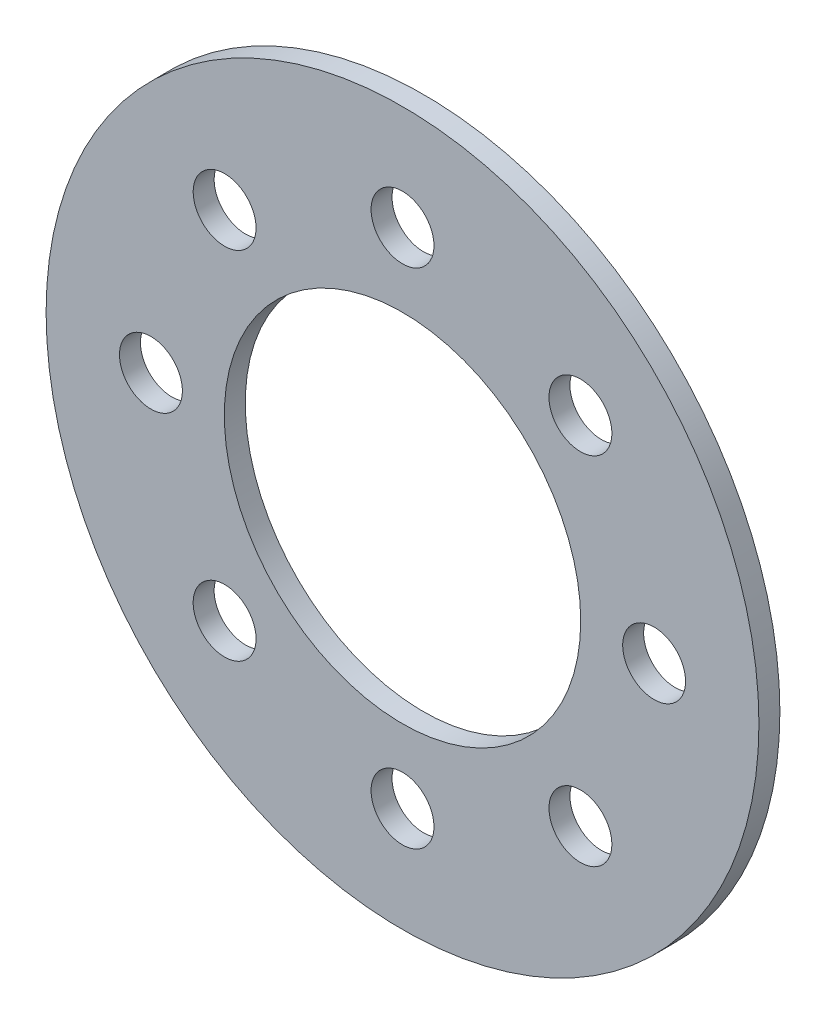
ISO-10303-21;
HEADER;
FILE_DESCRIPTION(('STEP AP214'),'2;1');
FILE_NAME('part.step','',(''),(''),'','','');
FILE_SCHEMA(('AUTOMOTIVE_DESIGN { 1 0 10303 214 1 1 1 1 }'));
ENDSEC;
DATA;
#1=APPLICATION_CONTEXT('core data for automotive mechanical design processes');
#2=APPLICATION_PROTOCOL_DEFINITION('international standard','automotive_design',2000,#1);
#3=PRODUCT_CONTEXT('',#1,'mechanical');
#4=PRODUCT('Part','Part','',(#3));
#5=PRODUCT_RELATED_PRODUCT_CATEGORY('part','',(#4));
#6=PRODUCT_DEFINITION_FORMATION('','',#4);
#7=PRODUCT_DEFINITION_CONTEXT('part definition',#1,'design');
#8=PRODUCT_DEFINITION('design','',#6,#7);
#9=PRODUCT_DEFINITION_SHAPE('','',#8);
#10=(LENGTH_UNIT() NAMED_UNIT(*) SI_UNIT(.MILLI.,.METRE.));
#11=(NAMED_UNIT(*) PLANE_ANGLE_UNIT() SI_UNIT($,.RADIAN.));
#12=(NAMED_UNIT(*) SI_UNIT($,.STERADIAN.) SOLID_ANGLE_UNIT());
#13=UNCERTAINTY_MEASURE_WITH_UNIT(LENGTH_MEASURE(1.E-05),#10,'distance_accuracy_value','');
#14=(GEOMETRIC_REPRESENTATION_CONTEXT(3) GLOBAL_UNCERTAINTY_ASSIGNED_CONTEXT((#13)) GLOBAL_UNIT_ASSIGNED_CONTEXT((#10,
#11,#12)) REPRESENTATION_CONTEXT('',''));
#15=CARTESIAN_POINT('',(0.,0.,0.));
#16=DIRECTION('',(0.,0.,1.));
#17=DIRECTION('',(1.,0.,0.));
#18=AXIS2_PLACEMENT_3D('',#15,#16,#17);
#19=CARTESIAN_POINT('',(0.,0.,1.));
#20=DIRECTION('',(0.,0.,1.));
#21=DIRECTION('',(1.,0.,0.));
#22=AXIS2_PLACEMENT_3D('',#19,#20,#21);
#23=PLANE('',#22);
#24=CARTESIAN_POINT('',(12.,0.,1.));
#25=DIRECTION('',(0.,0.,1.));
#26=DIRECTION('',(0.,-1.,0.));
#27=AXIS2_PLACEMENT_3D('',#24,#25,#26);
#28=CIRCLE('',#27,1.5);
#29=CARTESIAN_POINT('',(12.,-1.50000000000004,1.));
#30=VERTEX_POINT('',#29);
#31=EDGE_CURVE('E87',#30,#30,#28,.T.);
#32=ORIENTED_EDGE('',*,*,#31,.F.);
#33=EDGE_LOOP('',(#32));
#34=FACE_BOUND('',#33,.T.);
#35=CARTESIAN_POINT('',(8.48528137423853,-8.48528137423861,1.));
#36=DIRECTION('',(0.,0.,1.));
#37=DIRECTION('',(-0.707106781186551,-0.707106781186544,0.));
#38=AXIS2_PLACEMENT_3D('',#35,#36,#37);
#39=CIRCLE('',#38,1.5);
#40=CARTESIAN_POINT('',(7.4246212024587,-9.54594154601843,1.));
#41=VERTEX_POINT('',#40);
#42=EDGE_CURVE('E81',#41,#41,#39,.T.);
#43=ORIENTED_EDGE('',*,*,#42,.F.);
#44=EDGE_LOOP('',(#43));
#45=FACE_BOUND('',#44,.T.);
#46=CARTESIAN_POINT('',(0.,-12.,1.));
#47=DIRECTION('',(0.,0.,1.));
#48=DIRECTION('',(-1.,0.,0.));
#49=AXIS2_PLACEMENT_3D('',#46,#47,#48);
#50=CIRCLE('',#49,1.5);
#51=CARTESIAN_POINT('',(-1.5,-12.,1.));
#52=VERTEX_POINT('',#51);
#53=EDGE_CURVE('E75',#52,#52,#50,.T.);
#54=ORIENTED_EDGE('',*,*,#53,.F.);
#55=EDGE_LOOP('',(#54));
#56=FACE_BOUND('',#55,.T.);
#57=CARTESIAN_POINT('',(-8.48528137423864,-8.4852813742385,1.));
#58=DIRECTION('',(0.,0.,1.));
#59=DIRECTION('',(-0.707106781186541,0.707106781186554,0.));
#60=AXIS2_PLACEMENT_3D('',#57,#58,#59);
#61=CIRCLE('',#60,1.5);
#62=CARTESIAN_POINT('',(-9.54594154601845,-7.42462120245867,1.));
#63=VERTEX_POINT('',#62);
#64=EDGE_CURVE('E68',#63,#63,#61,.T.);
#65=ORIENTED_EDGE('',*,*,#64,.F.);
#66=EDGE_LOOP('',(#65));
#67=FACE_BOUND('',#66,.T.);
#68=CARTESIAN_POINT('',(-12.,1.25693328198353E-13,1.));
#69=DIRECTION('',(0.,0.,1.));
#70=DIRECTION('',(0.,1.,0.));
#71=AXIS2_PLACEMENT_3D('',#68,#69,#70);
#72=CIRCLE('',#71,1.5);
#73=CARTESIAN_POINT('',(-12.,1.50000000000012,1.));
#74=VERTEX_POINT('',#73);
#75=EDGE_CURVE('E98',#74,#74,#72,.T.);
#76=ORIENTED_EDGE('',*,*,#75,.F.);
#77=EDGE_LOOP('',(#76));
#78=FACE_BOUND('',#77,.T.);
#79=CARTESIAN_POINT('',(-8.48528137423847,8.48528137423867,1.));
#80=DIRECTION('',(0.,0.,1.));
#81=DIRECTION('',(0.707106781186556,0.707106781186539,0.));
#82=AXIS2_PLACEMENT_3D('',#79,#80,#81);
#83=CIRCLE('',#82,1.5);
#84=CARTESIAN_POINT('',(-7.42462120245863,9.54594154601848,1.));
#85=VERTEX_POINT('',#84);
#86=EDGE_CURVE('E92',#85,#85,#83,.T.);
#87=ORIENTED_EDGE('',*,*,#86,.F.);
#88=EDGE_LOOP('',(#87));
#89=FACE_BOUND('',#88,.T.);
#90=CARTESIAN_POINT('',(8.48528137423859,8.48528137423856,1.));
#91=DIRECTION('',(0.,0.,1.));
#92=DIRECTION('',(0.707106781186546,-0.707106781186549,0.));
#93=AXIS2_PLACEMENT_3D('',#90,#91,#92);
#94=CIRCLE('',#93,1.5);
#95=CARTESIAN_POINT('',(9.5459415460184,7.42462120245873,1.));
#96=VERTEX_POINT('',#95);
#97=EDGE_CURVE('E62',#96,#96,#94,.T.);
#98=ORIENTED_EDGE('',*,*,#97,.F.);
#99=EDGE_LOOP('',(#98));
#100=FACE_BOUND('',#99,.T.);
#101=CARTESIAN_POINT('',(0.,12.,1.));
#102=DIRECTION('',(0.,0.,1.));
#103=DIRECTION('',(1.,0.,0.));
#104=AXIS2_PLACEMENT_3D('',#101,#102,#103);
#105=CIRCLE('',#104,1.5);
#106=CARTESIAN_POINT('',(1.5,12.,1.));
#107=VERTEX_POINT('',#106);
#108=EDGE_CURVE('E56',#107,#107,#105,.T.);
#109=ORIENTED_EDGE('',*,*,#108,.F.);
#110=EDGE_LOOP('',(#109));
#111=FACE_BOUND('',#110,.T.);
#112=CARTESIAN_POINT('',(0.,0.,1.));
#113=DIRECTION('',(0.,0.,1.));
#114=DIRECTION('',(1.,0.,0.));
#115=AXIS2_PLACEMENT_3D('',#112,#113,#114);
#116=CIRCLE('',#115,17.);
#117=CARTESIAN_POINT('',(17.,0.,1.));
#118=VERTEX_POINT('',#117);
#119=EDGE_CURVE('E10',#118,#118,#116,.T.);
#120=ORIENTED_EDGE('',*,*,#119,.T.);
#121=EDGE_LOOP('',(#120));
#122=FACE_BOUND('',#121,.T.);
#123=CARTESIAN_POINT('',(0.,0.,1.));
#124=DIRECTION('',(0.,0.,1.));
#125=DIRECTION('',(1.,0.,0.));
#126=AXIS2_PLACEMENT_3D('',#123,#124,#125);
#127=CIRCLE('',#126,8.5);
#128=CARTESIAN_POINT('',(8.5,0.,1.));
#129=VERTEX_POINT('',#128);
#130=EDGE_CURVE('E48',#129,#129,#127,.T.);
#131=ORIENTED_EDGE('',*,*,#130,.F.);
#132=EDGE_LOOP('',(#131));
#133=FACE_BOUND('',#132,.T.);
#134=ADVANCED_FACE('F37',(#34,#45,#56,#67,#78,#89,#100,#111,#122,#133),#23,.T.);
#135=CARTESIAN_POINT('',(0.,0.,0.));
#136=DIRECTION('',(0.,0.,1.));
#137=DIRECTION('',(1.,0.,0.));
#138=AXIS2_PLACEMENT_3D('',#135,#136,#137);
#139=PLANE('',#138);
#140=CARTESIAN_POINT('',(12.,0.,0.));
#141=DIRECTION('',(0.,0.,1.));
#142=DIRECTION('',(0.,-1.,0.));
#143=AXIS2_PLACEMENT_3D('',#140,#141,#142);
#144=CIRCLE('',#143,1.5);
#145=CARTESIAN_POINT('',(12.,-1.50000000000004,0.));
#146=VERTEX_POINT('',#145);
#147=EDGE_CURVE('E65',#146,#146,#144,.T.);
#148=ORIENTED_EDGE('',*,*,#147,.T.);
#149=EDGE_LOOP('',(#148));
#150=FACE_BOUND('',#149,.T.);
#151=CARTESIAN_POINT('',(8.48528137423853,-8.48528137423861,0.));
#152=DIRECTION('',(0.,0.,1.));
#153=DIRECTION('',(-0.707106781186551,-0.707106781186544,0.));
#154=AXIS2_PLACEMENT_3D('',#151,#152,#153);
#155=CIRCLE('',#154,1.5);
#156=CARTESIAN_POINT('',(7.4246212024587,-9.54594154601843,0.));
#157=VERTEX_POINT('',#156);
#158=EDGE_CURVE('E84',#157,#157,#155,.T.);
#159=ORIENTED_EDGE('',*,*,#158,.T.);
#160=EDGE_LOOP('',(#159));
#161=FACE_BOUND('',#160,.T.);
#162=CARTESIAN_POINT('',(0.,-12.,0.));
#163=DIRECTION('',(0.,0.,1.));
#164=DIRECTION('',(-1.,0.,0.));
#165=AXIS2_PLACEMENT_3D('',#162,#163,#164);
#166=CIRCLE('',#165,1.5);
#167=CARTESIAN_POINT('',(-1.5,-12.,0.));
#168=VERTEX_POINT('',#167);
#169=EDGE_CURVE('E78',#168,#168,#166,.T.);
#170=ORIENTED_EDGE('',*,*,#169,.T.);
#171=EDGE_LOOP('',(#170));
#172=FACE_BOUND('',#171,.T.);
#173=CARTESIAN_POINT('',(-8.48528137423864,-8.4852813742385,0.));
#174=DIRECTION('',(0.,0.,1.));
#175=DIRECTION('',(-0.707106781186541,0.707106781186554,0.));
#176=AXIS2_PLACEMENT_3D('',#173,#174,#175);
#177=CIRCLE('',#176,1.5);
#178=CARTESIAN_POINT('',(-9.54594154601845,-7.42462120245867,0.));
#179=VERTEX_POINT('',#178);
#180=EDGE_CURVE('E71',#179,#179,#177,.T.);
#181=ORIENTED_EDGE('',*,*,#180,.T.);
#182=EDGE_LOOP('',(#181));
#183=FACE_BOUND('',#182,.T.);
#184=CARTESIAN_POINT('',(-12.,1.25693328198353E-13,0.));
#185=DIRECTION('',(0.,0.,1.));
#186=DIRECTION('',(0.,1.,0.));
#187=AXIS2_PLACEMENT_3D('',#184,#185,#186);
#188=CIRCLE('',#187,1.5);
#189=CARTESIAN_POINT('',(-12.,1.50000000000012,0.));
#190=VERTEX_POINT('',#189);
#191=EDGE_CURVE('E72',#190,#190,#188,.T.);
#192=ORIENTED_EDGE('',*,*,#191,.T.);
#193=EDGE_LOOP('',(#192));
#194=FACE_BOUND('',#193,.T.);
#195=CARTESIAN_POINT('',(-8.48528137423847,8.48528137423867,0.));
#196=DIRECTION('',(0.,0.,1.));
#197=DIRECTION('',(0.707106781186556,0.707106781186539,0.));
#198=AXIS2_PLACEMENT_3D('',#195,#196,#197);
#199=CIRCLE('',#198,1.5);
#200=CARTESIAN_POINT('',(-7.42462120245863,9.54594154601848,0.));
#201=VERTEX_POINT('',#200);
#202=EDGE_CURVE('E95',#201,#201,#199,.T.);
#203=ORIENTED_EDGE('',*,*,#202,.T.);
#204=EDGE_LOOP('',(#203));
#205=FACE_BOUND('',#204,.T.);
#206=CARTESIAN_POINT('',(8.48528137423859,8.48528137423856,0.));
#207=DIRECTION('',(0.,0.,1.));
#208=DIRECTION('',(0.707106781186546,-0.707106781186549,0.));
#209=AXIS2_PLACEMENT_3D('',#206,#207,#208);
#210=CIRCLE('',#209,1.5);
#211=CARTESIAN_POINT('',(9.5459415460184,7.42462120245873,0.));
#212=VERTEX_POINT('',#211);
#213=EDGE_CURVE('E59',#212,#212,#210,.T.);
#214=ORIENTED_EDGE('',*,*,#213,.T.);
#215=EDGE_LOOP('',(#214));
#216=FACE_BOUND('',#215,.T.);
#217=CARTESIAN_POINT('',(0.,12.,0.));
#218=DIRECTION('',(0.,0.,1.));
#219=DIRECTION('',(1.,0.,0.));
#220=AXIS2_PLACEMENT_3D('',#217,#218,#219);
#221=CIRCLE('',#220,1.5);
#222=CARTESIAN_POINT('',(1.5,12.,0.));
#223=VERTEX_POINT('',#222);
#224=EDGE_CURVE('E53',#223,#223,#221,.T.);
#225=ORIENTED_EDGE('',*,*,#224,.T.);
#226=EDGE_LOOP('',(#225));
#227=FACE_BOUND('',#226,.T.);
#228=CARTESIAN_POINT('',(0.,0.,0.));
#229=DIRECTION('',(0.,0.,1.));
#230=DIRECTION('',(1.,0.,0.));
#231=AXIS2_PLACEMENT_3D('',#228,#229,#230);
#232=CIRCLE('',#231,17.);
#233=CARTESIAN_POINT('',(17.,0.,0.));
#234=VERTEX_POINT('',#233);
#235=EDGE_CURVE('E41',#234,#234,#232,.T.);
#236=ORIENTED_EDGE('',*,*,#235,.F.);
#237=EDGE_LOOP('',(#236));
#238=FACE_BOUND('',#237,.T.);
#239=CARTESIAN_POINT('',(0.,0.,0.));
#240=DIRECTION('',(0.,0.,1.));
#241=DIRECTION('',(1.,0.,0.));
#242=AXIS2_PLACEMENT_3D('',#239,#240,#241);
#243=CIRCLE('',#242,8.5);
#244=CARTESIAN_POINT('',(8.5,0.,0.));
#245=VERTEX_POINT('',#244);
#246=EDGE_CURVE('E50',#245,#245,#243,.T.);
#247=ORIENTED_EDGE('',*,*,#246,.T.);
#248=EDGE_LOOP('',(#247));
#249=FACE_BOUND('',#248,.T.);
#250=ADVANCED_FACE('F104',(#150,#161,#172,#183,#194,#205,#216,#227,#238,#249),#139,.F.);
#251=CARTESIAN_POINT('',(0.,0.,1.));
#252=DIRECTION('',(0.,0.,-1.));
#253=DIRECTION('',(-1.,0.,0.));
#254=AXIS2_PLACEMENT_3D('',#251,#252,#253);
#255=CYLINDRICAL_SURFACE('',#254,17.);
#256=ORIENTED_EDGE('',*,*,#119,.F.);
#257=EDGE_LOOP('',(#256));
#258=FACE_BOUND('',#257,.T.);
#259=ORIENTED_EDGE('',*,*,#235,.T.);
#260=EDGE_LOOP('',(#259));
#261=FACE_BOUND('',#260,.T.);
#262=ADVANCED_FACE('F39',(#258,#261),#255,.T.);
#263=CARTESIAN_POINT('',(0.,0.,1.));
#264=DIRECTION('',(0.,0.,-1.));
#265=DIRECTION('',(-1.,0.,0.));
#266=AXIS2_PLACEMENT_3D('',#263,#264,#265);
#267=CYLINDRICAL_SURFACE('',#266,8.5);
#268=ORIENTED_EDGE('',*,*,#130,.T.);
#269=EDGE_LOOP('',(#268));
#270=FACE_BOUND('',#269,.T.);
#271=ORIENTED_EDGE('',*,*,#246,.F.);
#272=EDGE_LOOP('',(#271));
#273=FACE_BOUND('',#272,.T.);
#274=ADVANCED_FACE('F127',(#270,#273),#267,.F.);
#275=CARTESIAN_POINT('',(0.,12.,0.));
#276=DIRECTION('',(0.,0.,1.));
#277=DIRECTION('',(1.,0.,0.));
#278=AXIS2_PLACEMENT_3D('',#275,#276,#277);
#279=CYLINDRICAL_SURFACE('',#278,1.5);
#280=ORIENTED_EDGE('',*,*,#224,.F.);
#281=EDGE_LOOP('',(#280));
#282=FACE_BOUND('',#281,.T.);
#283=ORIENTED_EDGE('',*,*,#108,.T.);
#284=EDGE_LOOP('',(#283));
#285=FACE_BOUND('',#284,.T.);
#286=ADVANCED_FACE('F130',(#282,#285),#279,.F.);
#287=CARTESIAN_POINT('',(8.48528137423859,8.48528137423856,0.));
#288=DIRECTION('',(0.,0.,1.));
#289=DIRECTION('',(1.,0.,0.));
#290=AXIS2_PLACEMENT_3D('',#287,#288,#289);
#291=CYLINDRICAL_SURFACE('',#290,1.5);
#292=ORIENTED_EDGE('',*,*,#213,.F.);
#293=EDGE_LOOP('',(#292));
#294=FACE_BOUND('',#293,.T.);
#295=ORIENTED_EDGE('',*,*,#97,.T.);
#296=EDGE_LOOP('',(#295));
#297=FACE_BOUND('',#296,.T.);
#298=ADVANCED_FACE('F144',(#294,#297),#291,.F.);
#299=CARTESIAN_POINT('',(-8.48528137423847,8.48528137423867,0.));
#300=DIRECTION('',(0.,0.,1.));
#301=DIRECTION('',(1.,0.,0.));
#302=AXIS2_PLACEMENT_3D('',#299,#300,#301);
#303=CYLINDRICAL_SURFACE('',#302,1.5);
#304=ORIENTED_EDGE('',*,*,#202,.F.);
#305=EDGE_LOOP('',(#304));
#306=FACE_BOUND('',#305,.T.);
#307=ORIENTED_EDGE('',*,*,#86,.T.);
#308=EDGE_LOOP('',(#307));
#309=FACE_BOUND('',#308,.T.);
#310=ADVANCED_FACE('F111',(#306,#309),#303,.F.);
#311=CARTESIAN_POINT('',(-12.,1.25693328198353E-13,0.));
#312=DIRECTION('',(0.,0.,1.));
#313=DIRECTION('',(1.,0.,0.));
#314=AXIS2_PLACEMENT_3D('',#311,#312,#313);
#315=CYLINDRICAL_SURFACE('',#314,1.5);
#316=ORIENTED_EDGE('',*,*,#191,.F.);
#317=EDGE_LOOP('',(#316));
#318=FACE_BOUND('',#317,.T.);
#319=ORIENTED_EDGE('',*,*,#75,.T.);
#320=EDGE_LOOP('',(#319));
#321=FACE_BOUND('',#320,.T.);
#322=ADVANCED_FACE('F107',(#318,#321),#315,.F.);
#323=CARTESIAN_POINT('',(-8.48528137423864,-8.4852813742385,0.));
#324=DIRECTION('',(0.,0.,1.));
#325=DIRECTION('',(1.,0.,0.));
#326=AXIS2_PLACEMENT_3D('',#323,#324,#325);
#327=CYLINDRICAL_SURFACE('',#326,1.5);
#328=ORIENTED_EDGE('',*,*,#180,.F.);
#329=EDGE_LOOP('',(#328));
#330=FACE_BOUND('',#329,.T.);
#331=ORIENTED_EDGE('',*,*,#64,.T.);
#332=EDGE_LOOP('',(#331));
#333=FACE_BOUND('',#332,.T.);
#334=ADVANCED_FACE('F110',(#330,#333),#327,.F.);
#335=CARTESIAN_POINT('',(0.,-12.,0.));
#336=DIRECTION('',(0.,0.,1.));
#337=DIRECTION('',(1.,0.,0.));
#338=AXIS2_PLACEMENT_3D('',#335,#336,#337);
#339=CYLINDRICAL_SURFACE('',#338,1.5);
#340=ORIENTED_EDGE('',*,*,#169,.F.);
#341=EDGE_LOOP('',(#340));
#342=FACE_BOUND('',#341,.T.);
#343=ORIENTED_EDGE('',*,*,#53,.T.);
#344=EDGE_LOOP('',(#343));
#345=FACE_BOUND('',#344,.T.);
#346=ADVANCED_FACE('F151',(#342,#345),#339,.F.);
#347=CARTESIAN_POINT('',(8.48528137423853,-8.48528137423861,0.));
#348=DIRECTION('',(0.,0.,1.));
#349=DIRECTION('',(1.,0.,0.));
#350=AXIS2_PLACEMENT_3D('',#347,#348,#349);
#351=CYLINDRICAL_SURFACE('',#350,1.5);
#352=ORIENTED_EDGE('',*,*,#158,.F.);
#353=EDGE_LOOP('',(#352));
#354=FACE_BOUND('',#353,.T.);
#355=ORIENTED_EDGE('',*,*,#42,.T.);
#356=EDGE_LOOP('',(#355));
#357=FACE_BOUND('',#356,.T.);
#358=ADVANCED_FACE('F155',(#354,#357),#351,.F.);
#359=CARTESIAN_POINT('',(12.,0.,0.));
#360=DIRECTION('',(0.,0.,1.));
#361=DIRECTION('',(1.,0.,0.));
#362=AXIS2_PLACEMENT_3D('',#359,#360,#361);
#363=CYLINDRICAL_SURFACE('',#362,1.5);
#364=ORIENTED_EDGE('',*,*,#147,.F.);
#365=EDGE_LOOP('',(#364));
#366=FACE_BOUND('',#365,.T.);
#367=ORIENTED_EDGE('',*,*,#31,.T.);
#368=EDGE_LOOP('',(#367));
#369=FACE_BOUND('',#368,.T.);
#370=ADVANCED_FACE('F159',(#366,#369),#363,.F.);
#371=CLOSED_SHELL('',(#134,#250,#262,#274,#286,#298,#310,#322,#334,#346,#358,#370));
#372=MANIFOLD_SOLID_BREP('B2',#371);
#373=ADVANCED_BREP_SHAPE_REPRESENTATION('',(#18,#372),#14);
#374=SHAPE_DEFINITION_REPRESENTATION(#9,#373);
ENDSEC;
END-ISO-10303-21;
